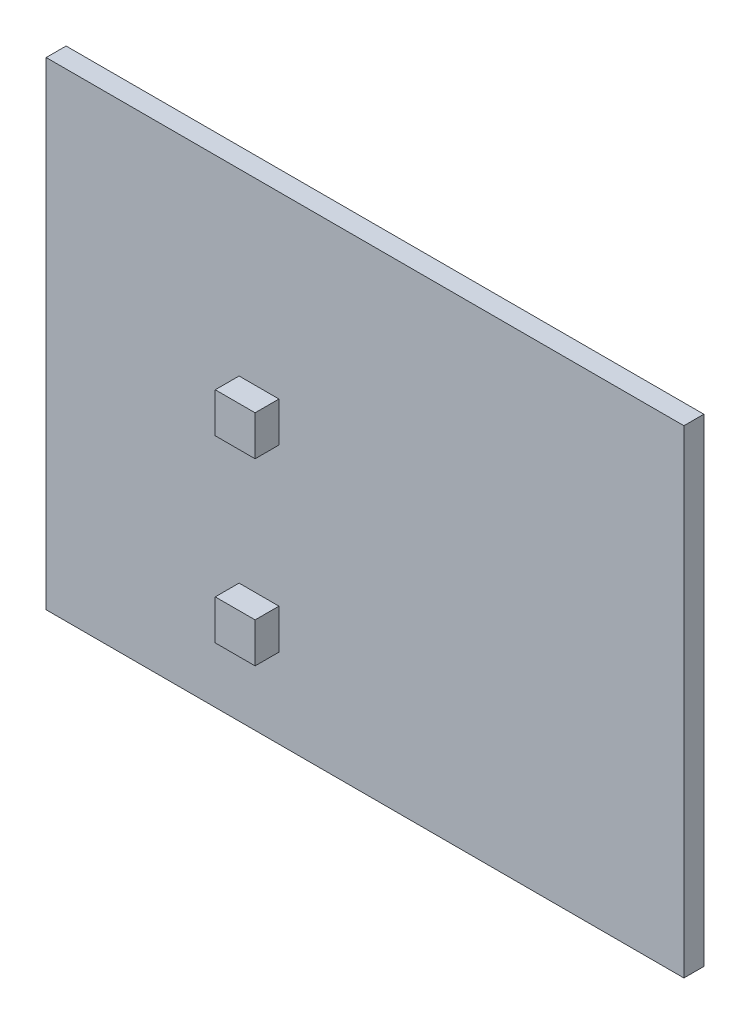
ISO-10303-21;
HEADER;
FILE_DESCRIPTION(('STEP AP214'),'2;1');
FILE_NAME('part.step','',(''),(''),'','','');
FILE_SCHEMA(('AUTOMOTIVE_DESIGN { 1 0 10303 214 1 1 1 1 }'));
ENDSEC;
DATA;
#1=APPLICATION_CONTEXT('core data for automotive mechanical design processes');
#2=APPLICATION_PROTOCOL_DEFINITION('international standard','automotive_design',2000,#1);
#3=PRODUCT_CONTEXT('',#1,'mechanical');
#4=PRODUCT('Part','Part','',(#3));
#5=PRODUCT_RELATED_PRODUCT_CATEGORY('part','',(#4));
#6=PRODUCT_DEFINITION_FORMATION('','',#4);
#7=PRODUCT_DEFINITION_CONTEXT('part definition',#1,'design');
#8=PRODUCT_DEFINITION('design','',#6,#7);
#9=PRODUCT_DEFINITION_SHAPE('','',#8);
#10=(LENGTH_UNIT() NAMED_UNIT(*) SI_UNIT(.MILLI.,.METRE.));
#11=(NAMED_UNIT(*) PLANE_ANGLE_UNIT() SI_UNIT($,.RADIAN.));
#12=(NAMED_UNIT(*) SI_UNIT($,.STERADIAN.) SOLID_ANGLE_UNIT());
#13=UNCERTAINTY_MEASURE_WITH_UNIT(LENGTH_MEASURE(1.E-05),#10,'distance_accuracy_value','');
#14=(GEOMETRIC_REPRESENTATION_CONTEXT(3) GLOBAL_UNCERTAINTY_ASSIGNED_CONTEXT((#13)) GLOBAL_UNIT_ASSIGNED_CONTEXT((#10,
#11,#12)) REPRESENTATION_CONTEXT('',''));
#15=CARTESIAN_POINT('',(0.,0.,0.));
#16=DIRECTION('',(0.,0.,1.));
#17=DIRECTION('',(1.,0.,0.));
#18=AXIS2_PLACEMENT_3D('',#15,#16,#17);
#19=CARTESIAN_POINT('',(0.,0.,2.5));
#20=DIRECTION('',(0.,0.,1.));
#21=DIRECTION('',(1.,0.,0.));
#22=AXIS2_PLACEMENT_3D('',#19,#20,#21);
#23=PLANE('',#22);
#24=DIRECTION('',(-1.,0.,0.));
#25=VECTOR('',#24,1.);
#26=CARTESIAN_POINT('',(-15.8,-15.,2.5));
#27=LINE('',#26,#25);
#28=CARTESIAN_POINT('',(-10.8,-15.,2.5));
#29=VERTEX_POINT('',#28);
#30=CARTESIAN_POINT('',(-15.8,-15.,2.5));
#31=VERTEX_POINT('',#30);
#32=EDGE_CURVE('E151',#29,#31,#27,.T.);
#33=ORIENTED_EDGE('',*,*,#32,.F.);
#34=DIRECTION('',(0.,1.,0.));
#35=VECTOR('',#34,1.);
#36=CARTESIAN_POINT('',(-10.8,-20.,2.5));
#37=LINE('',#36,#35);
#38=CARTESIAN_POINT('',(-10.8,-20.,2.5));
#39=VERTEX_POINT('',#38);
#40=EDGE_CURVE('E148',#39,#29,#37,.T.);
#41=ORIENTED_EDGE('',*,*,#40,.F.);
#42=DIRECTION('',(1.,0.,0.));
#43=VECTOR('',#42,1.);
#44=CARTESIAN_POINT('',(-15.8,-20.,2.5));
#45=LINE('',#44,#43);
#46=CARTESIAN_POINT('',(-15.8,-20.,2.5));
#47=VERTEX_POINT('',#46);
#48=EDGE_CURVE('E160',#47,#39,#45,.T.);
#49=ORIENTED_EDGE('',*,*,#48,.F.);
#50=DIRECTION('',(0.,-1.,0.));
#51=VECTOR('',#50,1.);
#52=CARTESIAN_POINT('',(-15.8,-20.,2.5));
#53=LINE('',#52,#51);
#54=EDGE_CURVE('E168',#31,#47,#53,.T.);
#55=ORIENTED_EDGE('',*,*,#54,.F.);
#56=EDGE_LOOP('',(#33,#41,#49,#55));
#57=FACE_BOUND('',#56,.T.);
#58=DIRECTION('',(0.,1.,0.));
#59=VECTOR('',#58,1.);
#60=CARTESIAN_POINT('',(40.,30.,2.5));
#61=LINE('',#60,#59);
#62=CARTESIAN_POINT('',(40.,-30.,2.5));
#63=VERTEX_POINT('',#62);
#64=CARTESIAN_POINT('',(40.,30.,2.5));
#65=VERTEX_POINT('',#64);
#66=EDGE_CURVE('E180',#63,#65,#61,.T.);
#67=ORIENTED_EDGE('',*,*,#66,.T.);
#68=DIRECTION('',(-1.,0.,0.));
#69=VECTOR('',#68,1.);
#70=CARTESIAN_POINT('',(-40.,30.,2.5));
#71=LINE('',#70,#69);
#72=CARTESIAN_POINT('',(-40.,30.,2.5));
#73=VERTEX_POINT('',#72);
#74=EDGE_CURVE('E183',#65,#73,#71,.T.);
#75=ORIENTED_EDGE('',*,*,#74,.T.);
#76=DIRECTION('',(0.,-1.,0.));
#77=VECTOR('',#76,1.);
#78=CARTESIAN_POINT('',(-40.,30.,2.5));
#79=LINE('',#78,#77);
#80=CARTESIAN_POINT('',(-40.,-30.,2.5));
#81=VERTEX_POINT('',#80);
#82=EDGE_CURVE('E186',#73,#81,#79,.T.);
#83=ORIENTED_EDGE('',*,*,#82,.T.);
#84=DIRECTION('',(1.,0.,0.));
#85=VECTOR('',#84,1.);
#86=CARTESIAN_POINT('',(-40.,-30.,2.5));
#87=LINE('',#86,#85);
#88=EDGE_CURVE('E188',#81,#63,#87,.T.);
#89=ORIENTED_EDGE('',*,*,#88,.T.);
#90=EDGE_LOOP('',(#67,#75,#83,#89));
#91=FACE_BOUND('',#90,.T.);
#92=DIRECTION('',(-1.,0.,0.));
#93=VECTOR('',#92,1.);
#94=CARTESIAN_POINT('',(-15.8,7.49999999999999,2.5));
#95=LINE('',#94,#93);
#96=CARTESIAN_POINT('',(-10.8,7.49999999999999,2.5));
#97=VERTEX_POINT('',#96);
#98=CARTESIAN_POINT('',(-15.8,7.49999999999999,2.5));
#99=VERTEX_POINT('',#98);
#100=EDGE_CURVE('E370',#97,#99,#95,.T.);
#101=ORIENTED_EDGE('',*,*,#100,.F.);
#102=DIRECTION('',(0.,1.,0.));
#103=VECTOR('',#102,1.);
#104=CARTESIAN_POINT('',(-10.8,2.49999999999999,2.5));
#105=LINE('',#104,#103);
#106=CARTESIAN_POINT('',(-10.8,2.49999999999999,2.5));
#107=VERTEX_POINT('',#106);
#108=EDGE_CURVE('E146',#107,#97,#105,.T.);
#109=ORIENTED_EDGE('',*,*,#108,.F.);
#110=DIRECTION('',(1.,0.,0.));
#111=VECTOR('',#110,1.);
#112=CARTESIAN_POINT('',(-15.8,2.49999999999999,2.5));
#113=LINE('',#112,#111);
#114=CARTESIAN_POINT('',(-15.8,2.49999999999999,2.5));
#115=VERTEX_POINT('',#114);
#116=EDGE_CURVE('E142',#115,#107,#113,.T.);
#117=ORIENTED_EDGE('',*,*,#116,.F.);
#118=DIRECTION('',(0.,-1.,0.));
#119=VECTOR('',#118,1.);
#120=CARTESIAN_POINT('',(-15.8,2.49999999999999,2.5));
#121=LINE('',#120,#119);
#122=EDGE_CURVE('E367',#99,#115,#121,.T.);
#123=ORIENTED_EDGE('',*,*,#122,.F.);
#124=EDGE_LOOP('',(#101,#109,#117,#123));
#125=FACE_BOUND('',#124,.T.);
#126=ADVANCED_FACE('F33',(#57,#91,#125),#23,.T.);
#127=CARTESIAN_POINT('',(40.,30.,2.5));
#128=DIRECTION('',(-1.,0.,0.));
#129=DIRECTION('',(0.,-1.,0.));
#130=AXIS2_PLACEMENT_3D('',#127,#128,#129);
#131=PLANE('',#130);
#132=DIRECTION('',(0.,1.,0.));
#133=VECTOR('',#132,1.);
#134=CARTESIAN_POINT('',(40.,30.,0.));
#135=LINE('',#134,#133);
#136=CARTESIAN_POINT('',(40.,-30.,0.));
#137=VERTEX_POINT('',#136);
#138=CARTESIAN_POINT('',(40.,30.,0.));
#139=VERTEX_POINT('',#138);
#140=EDGE_CURVE('E179',#137,#139,#135,.T.);
#141=ORIENTED_EDGE('',*,*,#140,.T.);
#142=DIRECTION('',(0.,0.,-1.));
#143=VECTOR('',#142,1.);
#144=CARTESIAN_POINT('',(40.,30.,2.5));
#145=LINE('',#144,#143);
#146=EDGE_CURVE('E11',#65,#139,#145,.T.);
#147=ORIENTED_EDGE('',*,*,#146,.F.);
#148=ORIENTED_EDGE('',*,*,#66,.F.);
#149=DIRECTION('',(0.,0.,-1.));
#150=VECTOR('',#149,1.);
#151=CARTESIAN_POINT('',(40.,-30.,2.5));
#152=LINE('',#151,#150);
#153=EDGE_CURVE('E190',#63,#137,#152,.T.);
#154=ORIENTED_EDGE('',*,*,#153,.T.);
#155=EDGE_LOOP('',(#141,#147,#148,#154));
#156=FACE_BOUND('',#155,.T.);
#157=ADVANCED_FACE('F35',(#156),#131,.F.);
#158=CARTESIAN_POINT('',(-40.,30.,2.5));
#159=DIRECTION('',(0.,-1.,0.));
#160=DIRECTION('',(0.,0.,-1.));
#161=AXIS2_PLACEMENT_3D('',#158,#159,#160);
#162=PLANE('',#161);
#163=DIRECTION('',(-1.,0.,0.));
#164=VECTOR('',#163,1.);
#165=CARTESIAN_POINT('',(-40.,30.,0.));
#166=LINE('',#165,#164);
#167=CARTESIAN_POINT('',(-40.,30.,0.));
#168=VERTEX_POINT('',#167);
#169=EDGE_CURVE('E193',#139,#168,#166,.T.);
#170=ORIENTED_EDGE('',*,*,#169,.T.);
#171=DIRECTION('',(0.,0.,-1.));
#172=VECTOR('',#171,1.);
#173=CARTESIAN_POINT('',(-40.,30.,2.5));
#174=LINE('',#173,#172);
#175=EDGE_CURVE('E41',#73,#168,#174,.T.);
#176=ORIENTED_EDGE('',*,*,#175,.F.);
#177=ORIENTED_EDGE('',*,*,#74,.F.);
#178=ORIENTED_EDGE('',*,*,#146,.T.);
#179=EDGE_LOOP('',(#170,#176,#177,#178));
#180=FACE_BOUND('',#179,.T.);
#181=ADVANCED_FACE('F223',(#180),#162,.F.);
#182=CARTESIAN_POINT('',(-40.,30.,2.5));
#183=DIRECTION('',(1.,0.,0.));
#184=DIRECTION('',(0.,0.,-1.));
#185=AXIS2_PLACEMENT_3D('',#182,#183,#184);
#186=PLANE('',#185);
#187=DIRECTION('',(0.,-1.,0.));
#188=VECTOR('',#187,1.);
#189=CARTESIAN_POINT('',(-40.,30.,0.));
#190=LINE('',#189,#188);
#191=CARTESIAN_POINT('',(-40.,-30.,0.));
#192=VERTEX_POINT('',#191);
#193=EDGE_CURVE('E195',#168,#192,#190,.T.);
#194=ORIENTED_EDGE('',*,*,#193,.T.);
#195=DIRECTION('',(0.,0.,-1.));
#196=VECTOR('',#195,1.);
#197=CARTESIAN_POINT('',(-40.,-30.,2.5));
#198=LINE('',#197,#196);
#199=EDGE_CURVE('E200',#81,#192,#198,.T.);
#200=ORIENTED_EDGE('',*,*,#199,.F.);
#201=ORIENTED_EDGE('',*,*,#82,.F.);
#202=ORIENTED_EDGE('',*,*,#175,.T.);
#203=EDGE_LOOP('',(#194,#200,#201,#202));
#204=FACE_BOUND('',#203,.T.);
#205=ADVANCED_FACE('F207',(#204),#186,.F.);
#206=CARTESIAN_POINT('',(-40.,-30.,2.5));
#207=DIRECTION('',(0.,1.,0.));
#208=DIRECTION('',(0.,0.,1.));
#209=AXIS2_PLACEMENT_3D('',#206,#207,#208);
#210=PLANE('',#209);
#211=DIRECTION('',(1.,0.,0.));
#212=VECTOR('',#211,1.);
#213=CARTESIAN_POINT('',(-40.,-30.,0.));
#214=LINE('',#213,#212);
#215=EDGE_CURVE('E184',#192,#137,#214,.T.);
#216=ORIENTED_EDGE('',*,*,#215,.T.);
#217=ORIENTED_EDGE('',*,*,#153,.F.);
#218=ORIENTED_EDGE('',*,*,#88,.F.);
#219=ORIENTED_EDGE('',*,*,#199,.T.);
#220=EDGE_LOOP('',(#216,#217,#218,#219));
#221=FACE_BOUND('',#220,.T.);
#222=ADVANCED_FACE('F216',(#221),#210,.F.);
#223=CARTESIAN_POINT('',(0.,0.,0.));
#224=DIRECTION('',(0.,0.,1.));
#225=DIRECTION('',(1.,0.,0.));
#226=AXIS2_PLACEMENT_3D('',#223,#224,#225);
#227=PLANE('',#226);
#228=ORIENTED_EDGE('',*,*,#140,.F.);
#229=ORIENTED_EDGE('',*,*,#215,.F.);
#230=ORIENTED_EDGE('',*,*,#193,.F.);
#231=ORIENTED_EDGE('',*,*,#169,.F.);
#232=EDGE_LOOP('',(#228,#229,#230,#231));
#233=FACE_BOUND('',#232,.T.);
#234=ADVANCED_FACE('F213',(#233),#227,.F.);
#235=CARTESIAN_POINT('',(-10.8,-20.,5.49));
#236=DIRECTION('',(-1.,0.,0.));
#237=DIRECTION('',(0.,0.,1.));
#238=AXIS2_PLACEMENT_3D('',#235,#236,#237);
#239=PLANE('',#238);
#240=ORIENTED_EDGE('',*,*,#40,.T.);
#241=DIRECTION('',(0.,0.,-1.));
#242=VECTOR('',#241,1.);
#243=CARTESIAN_POINT('',(-10.8,-15.,5.49));
#244=LINE('',#243,#242);
#245=CARTESIAN_POINT('',(-10.8,-15.,5.49));
#246=VERTEX_POINT('',#245);
#247=EDGE_CURVE('E177',#246,#29,#244,.T.);
#248=ORIENTED_EDGE('',*,*,#247,.F.);
#249=DIRECTION('',(0.,1.,0.));
#250=VECTOR('',#249,1.);
#251=CARTESIAN_POINT('',(-10.8,-20.,5.49));
#252=LINE('',#251,#250);
#253=CARTESIAN_POINT('',(-10.8,-20.,5.49));
#254=VERTEX_POINT('',#253);
#255=EDGE_CURVE('E156',#254,#246,#252,.T.);
#256=ORIENTED_EDGE('',*,*,#255,.F.);
#257=DIRECTION('',(0.,0.,-1.));
#258=VECTOR('',#257,1.);
#259=CARTESIAN_POINT('',(-10.8,-20.,5.49));
#260=LINE('',#259,#258);
#261=EDGE_CURVE('E165',#254,#39,#260,.T.);
#262=ORIENTED_EDGE('',*,*,#261,.T.);
#263=EDGE_LOOP('',(#240,#248,#256,#262));
#264=FACE_BOUND('',#263,.T.);
#265=ADVANCED_FACE('F238',(#264),#239,.F.);
#266=CARTESIAN_POINT('',(-15.8,-15.,5.49));
#267=DIRECTION('',(0.,-1.,0.));
#268=DIRECTION('',(0.,0.,-1.));
#269=AXIS2_PLACEMENT_3D('',#266,#267,#268);
#270=PLANE('',#269);
#271=ORIENTED_EDGE('',*,*,#32,.T.);
#272=DIRECTION('',(0.,0.,-1.));
#273=VECTOR('',#272,1.);
#274=CARTESIAN_POINT('',(-15.8,-15.,5.49));
#275=LINE('',#274,#273);
#276=CARTESIAN_POINT('',(-15.8,-15.,5.49));
#277=VERTEX_POINT('',#276);
#278=EDGE_CURVE('E174',#277,#31,#275,.T.);
#279=ORIENTED_EDGE('',*,*,#278,.F.);
#280=DIRECTION('',(-1.,0.,0.));
#281=VECTOR('',#280,1.);
#282=CARTESIAN_POINT('',(-15.8,-15.,5.49));
#283=LINE('',#282,#281);
#284=EDGE_CURVE('E159',#246,#277,#283,.T.);
#285=ORIENTED_EDGE('',*,*,#284,.F.);
#286=ORIENTED_EDGE('',*,*,#247,.T.);
#287=EDGE_LOOP('',(#271,#279,#285,#286));
#288=FACE_BOUND('',#287,.T.);
#289=ADVANCED_FACE('F257',(#288),#270,.F.);
#290=CARTESIAN_POINT('',(-15.8,-20.,5.49));
#291=DIRECTION('',(1.,0.,0.));
#292=DIRECTION('',(0.,0.,-1.));
#293=AXIS2_PLACEMENT_3D('',#290,#291,#292);
#294=PLANE('',#293);
#295=ORIENTED_EDGE('',*,*,#54,.T.);
#296=DIRECTION('',(0.,0.,-1.));
#297=VECTOR('',#296,1.);
#298=CARTESIAN_POINT('',(-15.8,-20.,5.49));
#299=LINE('',#298,#297);
#300=CARTESIAN_POINT('',(-15.8,-20.,5.49));
#301=VERTEX_POINT('',#300);
#302=EDGE_CURVE('E56',#301,#47,#299,.T.);
#303=ORIENTED_EDGE('',*,*,#302,.F.);
#304=DIRECTION('',(0.,-1.,0.));
#305=VECTOR('',#304,1.);
#306=CARTESIAN_POINT('',(-15.8,-20.,5.49));
#307=LINE('',#306,#305);
#308=EDGE_CURVE('E162',#277,#301,#307,.T.);
#309=ORIENTED_EDGE('',*,*,#308,.F.);
#310=ORIENTED_EDGE('',*,*,#278,.T.);
#311=EDGE_LOOP('',(#295,#303,#309,#310));
#312=FACE_BOUND('',#311,.T.);
#313=ADVANCED_FACE('F264',(#312),#294,.F.);
#314=CARTESIAN_POINT('',(-15.8,-20.,5.49));
#315=DIRECTION('',(0.,1.,0.));
#316=DIRECTION('',(0.,0.,1.));
#317=AXIS2_PLACEMENT_3D('',#314,#315,#316);
#318=PLANE('',#317);
#319=ORIENTED_EDGE('',*,*,#48,.T.);
#320=ORIENTED_EDGE('',*,*,#261,.F.);
#321=DIRECTION('',(1.,0.,0.));
#322=VECTOR('',#321,1.);
#323=CARTESIAN_POINT('',(-15.8,-20.,5.49));
#324=LINE('',#323,#322);
#325=EDGE_CURVE('E164',#301,#254,#324,.T.);
#326=ORIENTED_EDGE('',*,*,#325,.F.);
#327=ORIENTED_EDGE('',*,*,#302,.T.);
#328=EDGE_LOOP('',(#319,#320,#326,#327));
#329=FACE_BOUND('',#328,.T.);
#330=ADVANCED_FACE('F271',(#329),#318,.F.);
#331=CARTESIAN_POINT('',(0.,0.,5.49));
#332=DIRECTION('',(0.,0.,-1.));
#333=DIRECTION('',(-1.,0.,0.));
#334=AXIS2_PLACEMENT_3D('',#331,#332,#333);
#335=PLANE('',#334);
#336=ORIENTED_EDGE('',*,*,#255,.T.);
#337=ORIENTED_EDGE('',*,*,#284,.T.);
#338=ORIENTED_EDGE('',*,*,#308,.T.);
#339=ORIENTED_EDGE('',*,*,#325,.T.);
#340=EDGE_LOOP('',(#336,#337,#338,#339));
#341=FACE_BOUND('',#340,.T.);
#342=ADVANCED_FACE('F279',(#341),#335,.F.);
#343=CARTESIAN_POINT('',(-10.8,2.49999999999999,5.49));
#344=DIRECTION('',(-1.,0.,0.));
#345=DIRECTION('',(0.,0.,1.));
#346=AXIS2_PLACEMENT_3D('',#343,#344,#345);
#347=PLANE('',#346);
#348=ORIENTED_EDGE('',*,*,#108,.T.);
#349=DIRECTION('',(0.,0.,-1.));
#350=VECTOR('',#349,1.);
#351=CARTESIAN_POINT('',(-10.8,7.49999999999999,5.49));
#352=LINE('',#351,#350);
#353=CARTESIAN_POINT('',(-10.8,7.49999999999999,5.49));
#354=VERTEX_POINT('',#353);
#355=EDGE_CURVE('E127',#354,#97,#352,.T.);
#356=ORIENTED_EDGE('',*,*,#355,.F.);
#357=DIRECTION('',(0.,1.,0.));
#358=VECTOR('',#357,1.);
#359=CARTESIAN_POINT('',(-10.8,2.49999999999999,5.49));
#360=LINE('',#359,#358);
#361=CARTESIAN_POINT('',(-10.8,2.49999999999999,5.49));
#362=VERTEX_POINT('',#361);
#363=EDGE_CURVE('E134',#362,#354,#360,.T.);
#364=ORIENTED_EDGE('',*,*,#363,.F.);
#365=DIRECTION('',(0.,0.,-1.));
#366=VECTOR('',#365,1.);
#367=CARTESIAN_POINT('',(-10.8,2.49999999999999,5.49));
#368=LINE('',#367,#366);
#369=EDGE_CURVE('E365',#362,#107,#368,.T.);
#370=ORIENTED_EDGE('',*,*,#369,.T.);
#371=EDGE_LOOP('',(#348,#356,#364,#370));
#372=FACE_BOUND('',#371,.T.);
#373=ADVANCED_FACE('F144',(#372),#347,.F.);
#374=CARTESIAN_POINT('',(-15.8,7.49999999999999,5.49));
#375=DIRECTION('',(0.,-1.,0.));
#376=DIRECTION('',(0.,0.,-1.));
#377=AXIS2_PLACEMENT_3D('',#374,#375,#376);
#378=PLANE('',#377);
#379=ORIENTED_EDGE('',*,*,#100,.T.);
#380=DIRECTION('',(0.,0.,-1.));
#381=VECTOR('',#380,1.);
#382=CARTESIAN_POINT('',(-15.8,7.49999999999999,5.49));
#383=LINE('',#382,#381);
#384=CARTESIAN_POINT('',(-15.8,7.49999999999999,5.49));
#385=VERTEX_POINT('',#384);
#386=EDGE_CURVE('E130',#385,#99,#383,.T.);
#387=ORIENTED_EDGE('',*,*,#386,.F.);
#388=DIRECTION('',(-1.,0.,0.));
#389=VECTOR('',#388,1.);
#390=CARTESIAN_POINT('',(-15.8,7.49999999999999,5.49));
#391=LINE('',#390,#389);
#392=EDGE_CURVE('E123',#354,#385,#391,.T.);
#393=ORIENTED_EDGE('',*,*,#392,.F.);
#394=ORIENTED_EDGE('',*,*,#355,.T.);
#395=EDGE_LOOP('',(#379,#387,#393,#394));
#396=FACE_BOUND('',#395,.T.);
#397=ADVANCED_FACE('F125',(#396),#378,.F.);
#398=CARTESIAN_POINT('',(-15.8,2.49999999999999,5.49));
#399=DIRECTION('',(1.,0.,0.));
#400=DIRECTION('',(0.,0.,-1.));
#401=AXIS2_PLACEMENT_3D('',#398,#399,#400);
#402=PLANE('',#401);
#403=ORIENTED_EDGE('',*,*,#122,.T.);
#404=DIRECTION('',(0.,0.,-1.));
#405=VECTOR('',#404,1.);
#406=CARTESIAN_POINT('',(-15.8,2.49999999999999,5.49));
#407=LINE('',#406,#405);
#408=CARTESIAN_POINT('',(-15.8,2.49999999999999,5.49));
#409=VERTEX_POINT('',#408);
#410=EDGE_CURVE('E48',#409,#115,#407,.T.);
#411=ORIENTED_EDGE('',*,*,#410,.F.);
#412=DIRECTION('',(0.,-1.,0.));
#413=VECTOR('',#412,1.);
#414=CARTESIAN_POINT('',(-15.8,2.49999999999999,5.49));
#415=LINE('',#414,#413);
#416=EDGE_CURVE('E133',#385,#409,#415,.T.);
#417=ORIENTED_EDGE('',*,*,#416,.F.);
#418=ORIENTED_EDGE('',*,*,#386,.T.);
#419=EDGE_LOOP('',(#403,#411,#417,#418));
#420=FACE_BOUND('',#419,.T.);
#421=ADVANCED_FACE('F299',(#420),#402,.F.);
#422=CARTESIAN_POINT('',(-15.8,2.49999999999999,5.49));
#423=DIRECTION('',(0.,1.,0.));
#424=DIRECTION('',(0.,0.,1.));
#425=AXIS2_PLACEMENT_3D('',#422,#423,#424);
#426=PLANE('',#425);
#427=ORIENTED_EDGE('',*,*,#116,.T.);
#428=ORIENTED_EDGE('',*,*,#369,.F.);
#429=DIRECTION('',(1.,0.,0.));
#430=VECTOR('',#429,1.);
#431=CARTESIAN_POINT('',(-15.8,2.49999999999999,5.49));
#432=LINE('',#431,#430);
#433=EDGE_CURVE('E138',#409,#362,#432,.T.);
#434=ORIENTED_EDGE('',*,*,#433,.F.);
#435=ORIENTED_EDGE('',*,*,#410,.T.);
#436=EDGE_LOOP('',(#427,#428,#434,#435));
#437=FACE_BOUND('',#436,.T.);
#438=ADVANCED_FACE('F306',(#437),#426,.F.);
#439=CARTESIAN_POINT('',(0.,0.,5.49));
#440=DIRECTION('',(0.,0.,-1.));
#441=DIRECTION('',(-1.,0.,0.));
#442=AXIS2_PLACEMENT_3D('',#439,#440,#441);
#443=PLANE('',#442);
#444=ORIENTED_EDGE('',*,*,#363,.T.);
#445=ORIENTED_EDGE('',*,*,#392,.T.);
#446=ORIENTED_EDGE('',*,*,#416,.T.);
#447=ORIENTED_EDGE('',*,*,#433,.T.);
#448=EDGE_LOOP('',(#444,#445,#446,#447));
#449=FACE_BOUND('',#448,.T.);
#450=ADVANCED_FACE('F137',(#449),#443,.F.);
#451=CLOSED_SHELL('',(#126,#157,#181,#205,#222,#234,#265,#289,#313,#330,#342,#373,#397,#421,
#438,#450));
#452=MANIFOLD_SOLID_BREP('B2',#451);
#453=ADVANCED_BREP_SHAPE_REPRESENTATION('',(#18,#452),#14);
#454=SHAPE_DEFINITION_REPRESENTATION(#9,#453);
ENDSEC;
END-ISO-10303-21;
